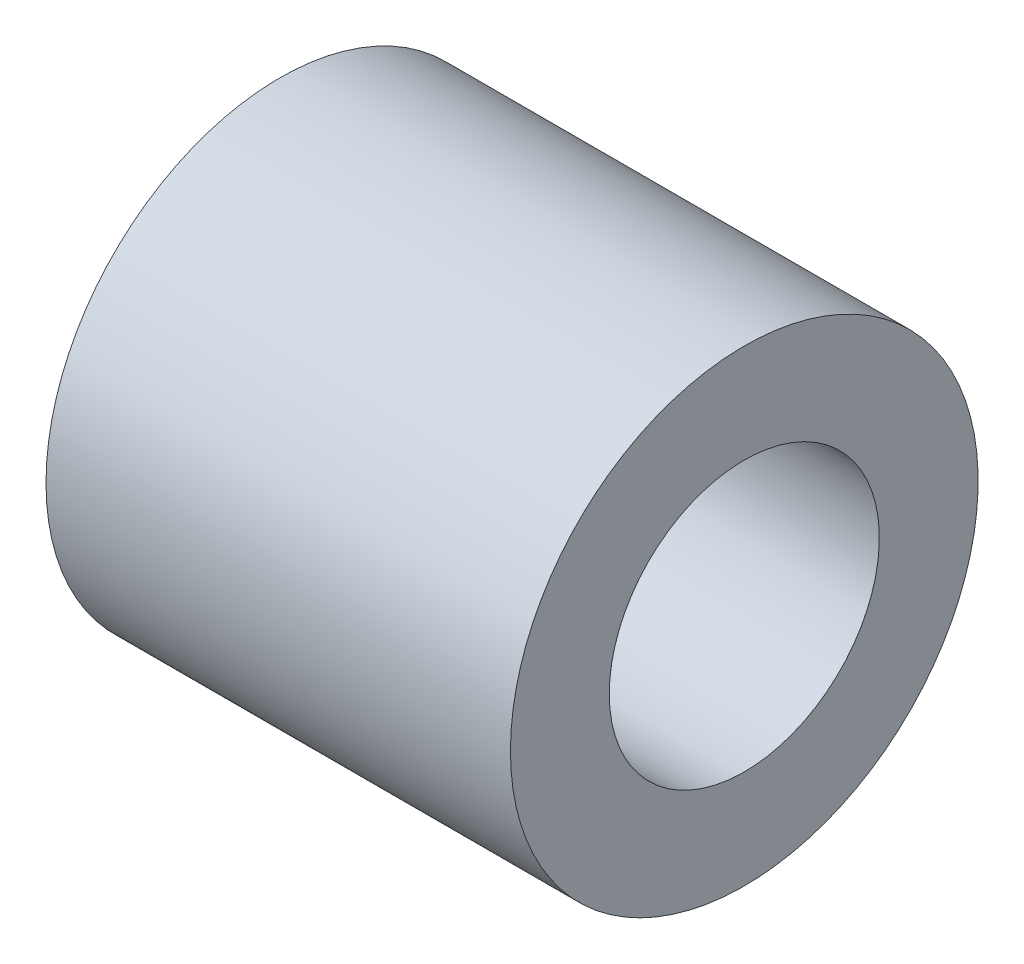
ISO-10303-21;
HEADER;
FILE_DESCRIPTION(('STEP AP214'),'2;1');
FILE_NAME('part.step','',(''),(''),'','','');
FILE_SCHEMA(('AUTOMOTIVE_DESIGN { 1 0 10303 214 1 1 1 1 }'));
ENDSEC;
DATA;
#1=APPLICATION_CONTEXT('core data for automotive mechanical design processes');
#2=APPLICATION_PROTOCOL_DEFINITION('international standard','automotive_design',2000,#1);
#3=PRODUCT_CONTEXT('',#1,'mechanical');
#4=PRODUCT('Part','Part','',(#3));
#5=PRODUCT_RELATED_PRODUCT_CATEGORY('part','',(#4));
#6=PRODUCT_DEFINITION_FORMATION('','',#4);
#7=PRODUCT_DEFINITION_CONTEXT('part definition',#1,'design');
#8=PRODUCT_DEFINITION('design','',#6,#7);
#9=PRODUCT_DEFINITION_SHAPE('','',#8);
#10=(LENGTH_UNIT() NAMED_UNIT(*) SI_UNIT(.MILLI.,.METRE.));
#11=(NAMED_UNIT(*) PLANE_ANGLE_UNIT() SI_UNIT($,.RADIAN.));
#12=(NAMED_UNIT(*) SI_UNIT($,.STERADIAN.) SOLID_ANGLE_UNIT());
#13=UNCERTAINTY_MEASURE_WITH_UNIT(LENGTH_MEASURE(1.E-05),#10,'distance_accuracy_value','');
#14=(GEOMETRIC_REPRESENTATION_CONTEXT(3) GLOBAL_UNCERTAINTY_ASSIGNED_CONTEXT((#13)) GLOBAL_UNIT_ASSIGNED_CONTEXT((#10,
#11,#12)) REPRESENTATION_CONTEXT('',''));
#15=CARTESIAN_POINT('',(0.,0.,0.));
#16=DIRECTION('',(0.,0.,1.));
#17=DIRECTION('',(1.,0.,0.));
#18=AXIS2_PLACEMENT_3D('',#15,#16,#17);
#19=CARTESIAN_POINT('',(14.1,0.,0.));
#20=DIRECTION('',(-1.,0.,0.));
#21=DIRECTION('',(0.,0.,1.));
#22=AXIS2_PLACEMENT_3D('',#19,#20,#21);
#23=PLANE('',#22);
#24=CARTESIAN_POINT('',(14.1,0.,0.));
#25=DIRECTION('',(-1.,0.,0.));
#26=DIRECTION('',(0.,0.,1.));
#27=AXIS2_PLACEMENT_3D('',#24,#25,#26);
#28=CIRCLE('',#27,7.1);
#29=CARTESIAN_POINT('',(14.1,0.,7.1));
#30=VERTEX_POINT('',#29);
#31=EDGE_CURVE('E51',#30,#30,#28,.T.);
#32=ORIENTED_EDGE('',*,*,#31,.F.);
#33=EDGE_LOOP('',(#32));
#34=FACE_BOUND('',#33,.T.);
#35=CARTESIAN_POINT('',(14.1,0.,0.));
#36=DIRECTION('',(-1.,0.,0.));
#37=DIRECTION('',(0.,0.,1.));
#38=AXIS2_PLACEMENT_3D('',#35,#36,#37);
#39=CIRCLE('',#38,4.1);
#40=CARTESIAN_POINT('',(14.1,0.,4.1));
#41=VERTEX_POINT('',#40);
#42=EDGE_CURVE('E10',#41,#41,#39,.T.);
#43=ORIENTED_EDGE('',*,*,#42,.T.);
#44=EDGE_LOOP('',(#43));
#45=FACE_BOUND('',#44,.T.);
#46=ADVANCED_FACE('F37',(#34,#45),#23,.F.);
#47=CARTESIAN_POINT('',(0.,0.,0.));
#48=DIRECTION('',(-1.,0.,0.));
#49=DIRECTION('',(0.,0.,1.));
#50=AXIS2_PLACEMENT_3D('',#47,#48,#49);
#51=CYLINDRICAL_SURFACE('',#50,4.1);
#52=ORIENTED_EDGE('',*,*,#42,.F.);
#53=EDGE_LOOP('',(#52));
#54=FACE_BOUND('',#53,.T.);
#55=CARTESIAN_POINT('',(0.,0.,0.));
#56=DIRECTION('',(-1.,0.,0.));
#57=DIRECTION('',(0.,0.,1.));
#58=AXIS2_PLACEMENT_3D('',#55,#56,#57);
#59=CIRCLE('',#58,4.1);
#60=CARTESIAN_POINT('',(0.,0.,4.1));
#61=VERTEX_POINT('',#60);
#62=EDGE_CURVE('E43',#61,#61,#59,.T.);
#63=ORIENTED_EDGE('',*,*,#62,.T.);
#64=EDGE_LOOP('',(#63));
#65=FACE_BOUND('',#64,.T.);
#66=ADVANCED_FACE('F61',(#54,#65),#51,.F.);
#67=CARTESIAN_POINT('',(0.,0.,0.));
#68=DIRECTION('',(-1.,0.,0.));
#69=DIRECTION('',(0.,0.,1.));
#70=AXIS2_PLACEMENT_3D('',#67,#68,#69);
#71=PLANE('',#70);
#72=CARTESIAN_POINT('',(0.,0.,0.));
#73=DIRECTION('',(-1.,0.,0.));
#74=DIRECTION('',(0.,0.,1.));
#75=AXIS2_PLACEMENT_3D('',#72,#73,#74);
#76=CIRCLE('',#75,7.1);
#77=CARTESIAN_POINT('',(0.,0.,7.1));
#78=VERTEX_POINT('',#77);
#79=EDGE_CURVE('E47',#78,#78,#76,.T.);
#80=ORIENTED_EDGE('',*,*,#79,.T.);
#81=EDGE_LOOP('',(#80));
#82=FACE_BOUND('',#81,.T.);
#83=ORIENTED_EDGE('',*,*,#62,.F.);
#84=EDGE_LOOP('',(#83));
#85=FACE_BOUND('',#84,.T.);
#86=ADVANCED_FACE('F65',(#82,#85),#71,.T.);
#87=CARTESIAN_POINT('',(0.,0.,0.));
#88=DIRECTION('',(-1.,0.,0.));
#89=DIRECTION('',(0.,0.,1.));
#90=AXIS2_PLACEMENT_3D('',#87,#88,#89);
#91=CYLINDRICAL_SURFACE('',#90,7.1);
#92=ORIENTED_EDGE('',*,*,#31,.T.);
#93=EDGE_LOOP('',(#92));
#94=FACE_BOUND('',#93,.T.);
#95=ORIENTED_EDGE('',*,*,#79,.F.);
#96=EDGE_LOOP('',(#95));
#97=FACE_BOUND('',#96,.T.);
#98=ADVANCED_FACE('F57',(#94,#97),#91,.T.);
#99=CLOSED_SHELL('',(#46,#66,#86,#98));
#100=MANIFOLD_SOLID_BREP('B2',#99);
#101=ADVANCED_BREP_SHAPE_REPRESENTATION('',(#18,#100),#14);
#102=SHAPE_DEFINITION_REPRESENTATION(#9,#101);
ENDSEC;
END-ISO-10303-21;
